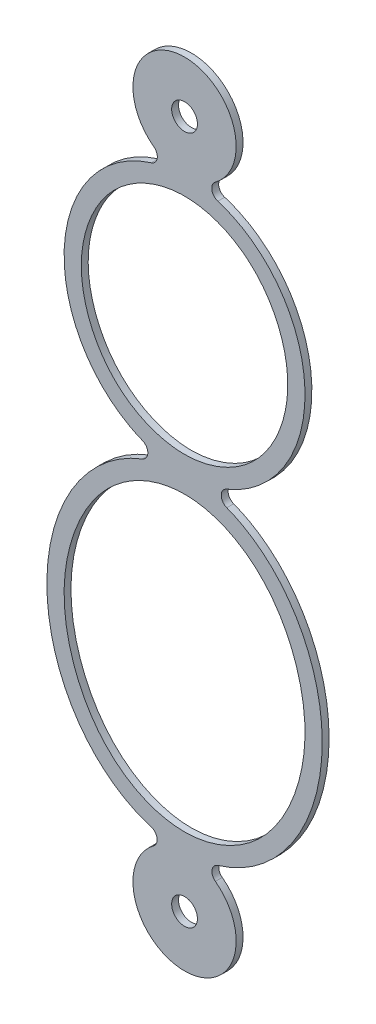
ISO-10303-21;
HEADER;
FILE_DESCRIPTION(('STEP AP214'),'2;1');
FILE_NAME('part.step','',(''),(''),'','','');
FILE_SCHEMA(('AUTOMOTIVE_DESIGN { 1 0 10303 214 1 1 1 1 }'));
ENDSEC;
DATA;
#1=APPLICATION_CONTEXT('core data for automotive mechanical design processes');
#2=APPLICATION_PROTOCOL_DEFINITION('international standard','automotive_design',2000,#1);
#3=PRODUCT_CONTEXT('',#1,'mechanical');
#4=PRODUCT('Part','Part','',(#3));
#5=PRODUCT_RELATED_PRODUCT_CATEGORY('part','',(#4));
#6=PRODUCT_DEFINITION_FORMATION('','',#4);
#7=PRODUCT_DEFINITION_CONTEXT('part definition',#1,'design');
#8=PRODUCT_DEFINITION('design','',#6,#7);
#9=PRODUCT_DEFINITION_SHAPE('','',#8);
#10=(LENGTH_UNIT() NAMED_UNIT(*) SI_UNIT(.MILLI.,.METRE.));
#11=(NAMED_UNIT(*) PLANE_ANGLE_UNIT() SI_UNIT($,.RADIAN.));
#12=(NAMED_UNIT(*) SI_UNIT($,.STERADIAN.) SOLID_ANGLE_UNIT());
#13=UNCERTAINTY_MEASURE_WITH_UNIT(LENGTH_MEASURE(1.E-05),#10,'distance_accuracy_value','');
#14=(GEOMETRIC_REPRESENTATION_CONTEXT(3) GLOBAL_UNCERTAINTY_ASSIGNED_CONTEXT((#13)) GLOBAL_UNIT_ASSIGNED_CONTEXT((#10,
#11,#12)) REPRESENTATION_CONTEXT('',''));
#15=CARTESIAN_POINT('',(0.,0.,0.));
#16=DIRECTION('',(0.,0.,1.));
#17=DIRECTION('',(1.,0.,0.));
#18=AXIS2_PLACEMENT_3D('',#15,#16,#17);
#19=CARTESIAN_POINT('',(0.,4.75,0.1));
#20=DIRECTION('',(0.,0.,1.));
#21=DIRECTION('',(1.,0.,0.));
#22=AXIS2_PLACEMENT_3D('',#19,#20,#21);
#23=PLANE('',#22);
#24=CARTESIAN_POINT('',(0.,1.5,0.1));
#25=CARTESIAN_POINT('',(0.77676920001799,1.5,0.1));
#26=CARTESIAN_POINT('',(2.33030760005397,2.18201490696649,0.1));
#27=CARTESIAN_POINT('',(3.33484619997302,4.75,0.1));
#28=CARTESIAN_POINT('',(2.33030760005397,7.31798509303351,0.1));
#29=CARTESIAN_POINT('',(0.,8.34100745348325,0.1));
#30=CARTESIAN_POINT('',(-2.33030760005397,7.31798509303351,0.1));
#31=CARTESIAN_POINT('',(-3.33484619997302,4.75,0.1));
#32=CARTESIAN_POINT('',(-2.33030760005397,2.18201490696649,0.1));
#33=CARTESIAN_POINT('',(-0.77676920001799,1.5,0.1));
#34=CARTESIAN_POINT('',(0.,1.5,0.1));
#35=B_SPLINE_CURVE_WITH_KNOTS('',3,(#24,#25,#26,#27,#28,#29,#30,#31,#32,#33,#34),.UNSPECIFIED.,
.T.,.F.,(4,1,1,1,1,1,1,1,4),(0.,0.785398163397448,1.5707963267949,2.35619449019234,
3.14159265358979,3.92699081698724,4.71238898038469,5.49778714378214,6.28318530717959),.UNSPECIFIED.);
#36=CARTESIAN_POINT('',(0.,1.5,0.1));
#37=VERTEX_POINT('',#36);
#38=EDGE_CURVE('E266',#37,#37,#35,.T.);
#39=ORIENTED_EDGE('',*,*,#38,.F.);
#40=EDGE_LOOP('',(#39));
#41=FACE_BOUND('',#40,.T.);
#42=CARTESIAN_POINT('',(0.,10.,0.1));
#43=DIRECTION('',(0.,0.,1.));
#44=DIRECTION('',(1.,0.,0.));
#45=AXIS2_PLACEMENT_3D('',#42,#43,#44);
#46=CIRCLE('',#45,0.375);
#47=CARTESIAN_POINT('',(0.374999999999999,10.,0.1));
#48=VERTEX_POINT('',#47);
#49=EDGE_CURVE('E160',#48,#48,#46,.T.);
#50=ORIENTED_EDGE('',*,*,#49,.F.);
#51=EDGE_LOOP('',(#50));
#52=FACE_BOUND('',#51,.T.);
#53=CARTESIAN_POINT('',(0.,4.75,0.1));
#54=DIRECTION('',(0.,0.,1.));
#55=DIRECTION('',(0.,-1.,0.));
#56=AXIS2_PLACEMENT_3D('',#53,#54,#55);
#57=ELLIPSE('',#56,3.75,3.5);
#58=CARTESIAN_POINT('',(-0.96696853472412,8.35404298690924,0.1));
#59=VERTEX_POINT('',#58);
#60=CARTESIAN_POINT('',(-1.22357103550407,1.23661696244466,0.1));
#61=VERTEX_POINT('',#60);
#62=EDGE_CURVE('E179',#59,#61,#57,.T.);
#63=ORIENTED_EDGE('',*,*,#62,.T.);
#64=CARTESIAN_POINT('',(-1.31637634818871,1.00448085164432,0.1));
#65=DIRECTION('',(0.,0.,-1.));
#66=DIRECTION('',(1.,0.,0.));
#67=AXIS2_PLACEMENT_3D('',#64,#65,#66);
#68=CIRCLE('',#67,0.25);
#69=CARTESIAN_POINT('',(-1.22701678477114,0.77099665854804,0.1));
#70=VERTEX_POINT('',#69);
#71=EDGE_CURVE('E107',#61,#70,#68,.T.);
#72=ORIENTED_EDGE('',*,*,#71,.T.);
#73=CARTESIAN_POINT('',(0.,-3.75,0.1));
#74=DIRECTION('',(0.,0.,1.));
#75=DIRECTION('',(0.,-1.,0.));
#76=AXIS2_PLACEMENT_3D('',#73,#74,#75);
#77=ELLIPSE('',#76,4.75,4.);
#78=CARTESIAN_POINT('',(-0.974024896603258,-8.3570218382292,0.1));
#79=VERTEX_POINT('',#78);
#80=EDGE_CURVE('E206',#70,#79,#77,.T.);
#81=ORIENTED_EDGE('',*,*,#80,.T.);
#82=CARTESIAN_POINT('',(-1.04545245373619,-8.59660085250638,0.1));
#83=DIRECTION('',(0.,0.,-1.));
#84=DIRECTION('',(1.,0.,0.));
#85=AXIS2_PLACEMENT_3D('',#82,#83,#84);
#86=CIRCLE('',#85,0.250000000025575);
#87=CARTESIAN_POINT('',(-0.896102103192263,-8.79708644501914,0.1));
#88=VERTEX_POINT('',#87);
#89=EDGE_CURVE('E225',#79,#88,#86,.T.);
#90=ORIENTED_EDGE('',*,*,#89,.T.);
#91=CARTESIAN_POINT('',(0.,-10.,0.1));
#92=DIRECTION('',(0.,0.,1.));
#93=DIRECTION('',(1.,0.,0.));
#94=AXIS2_PLACEMENT_3D('',#91,#92,#93);
#95=CIRCLE('',#94,1.50000000000852);
#96=CARTESIAN_POINT('',(0.896102103176992,-8.79708644503965,0.1));
#97=VERTEX_POINT('',#96);
#98=EDGE_CURVE('E222',#88,#97,#95,.T.);
#99=ORIENTED_EDGE('',*,*,#98,.T.);
#100=CARTESIAN_POINT('',(1.0454524537362,-8.59660085250638,0.1));
#101=DIRECTION('',(0.,0.,-1.));
#102=DIRECTION('',(1.,0.,0.));
#103=AXIS2_PLACEMENT_3D('',#100,#101,#102);
#104=CIRCLE('',#103,0.250000000025575);
#105=CARTESIAN_POINT('',(0.974024896595954,-8.35702183820469,0.1));
#106=VERTEX_POINT('',#105);
#107=EDGE_CURVE('E224',#97,#106,#104,.T.);
#108=ORIENTED_EDGE('',*,*,#107,.T.);
#109=CARTESIAN_POINT('',(0.,-3.75,0.1));
#110=DIRECTION('',(0.,0.,1.));
#111=DIRECTION('',(0.,-1.,0.));
#112=AXIS2_PLACEMENT_3D('',#109,#110,#111);
#113=ELLIPSE('',#112,4.75,4.);
#114=CARTESIAN_POINT('',(1.22701678477114,0.770996658548041,0.1));
#115=VERTEX_POINT('',#114);
#116=EDGE_CURVE('E227',#106,#115,#113,.T.);
#117=ORIENTED_EDGE('',*,*,#116,.T.);
#118=CARTESIAN_POINT('',(1.31637634818871,1.00448085164432,0.1));
#119=DIRECTION('',(0.,0.,-1.));
#120=DIRECTION('',(1.,0.,0.));
#121=AXIS2_PLACEMENT_3D('',#118,#119,#120);
#122=CIRCLE('',#121,0.25);
#123=CARTESIAN_POINT('',(1.22357103550407,1.23661696244466,0.1));
#124=VERTEX_POINT('',#123);
#125=EDGE_CURVE('E234',#115,#124,#122,.T.);
#126=ORIENTED_EDGE('',*,*,#125,.T.);
#127=CARTESIAN_POINT('',(0.,4.75,0.1));
#128=DIRECTION('',(0.,0.,1.));
#129=DIRECTION('',(0.,-1.,0.));
#130=AXIS2_PLACEMENT_3D('',#127,#128,#129);
#131=ELLIPSE('',#130,3.75,3.5);
#132=CARTESIAN_POINT('',(0.966968534724127,8.35404298690928,0.1));
#133=VERTEX_POINT('',#132);
#134=EDGE_CURVE('E138',#124,#133,#131,.T.);
#135=ORIENTED_EDGE('',*,*,#134,.T.);
#136=CARTESIAN_POINT('',(1.04055685860177,8.5929671560276,0.1));
#137=DIRECTION('',(0.,0.,-1.));
#138=DIRECTION('',(1.,0.,0.));
#139=AXIS2_PLACEMENT_3D('',#136,#137,#138);
#140=CIRCLE('',#139,0.250000000000038);
#141=CARTESIAN_POINT('',(0.891905878801503,8.79397184802368,0.1));
#142=VERTEX_POINT('',#141);
#143=EDGE_CURVE('E132',#133,#142,#140,.T.);
#144=ORIENTED_EDGE('',*,*,#143,.T.);
#145=CARTESIAN_POINT('',(0.,10.,0.1));
#146=DIRECTION('',(0.,0.,1.));
#147=DIRECTION('',(1.,0.,0.));
#148=AXIS2_PLACEMENT_3D('',#145,#146,#147);
#149=CIRCLE('',#148,1.5);
#150=CARTESIAN_POINT('',(-0.891905878801481,8.79397184802371,0.1));
#151=VERTEX_POINT('',#150);
#152=EDGE_CURVE('E136',#142,#151,#149,.T.);
#153=ORIENTED_EDGE('',*,*,#152,.T.);
#154=CARTESIAN_POINT('',(-1.04055685860177,8.5929671560276,0.1));
#155=DIRECTION('',(0.,0.,-1.));
#156=DIRECTION('',(1.,0.,0.));
#157=AXIS2_PLACEMENT_3D('',#154,#155,#156);
#158=CIRCLE('',#157,0.250000000000037);
#159=EDGE_CURVE('E52',#151,#59,#158,.T.);
#160=ORIENTED_EDGE('',*,*,#159,.T.);
#161=EDGE_LOOP('',(#63,#72,#81,#90,#99,#108,#117,#126,#135,#144,#153,#160));
#162=FACE_BOUND('',#161,.T.);
#163=CARTESIAN_POINT('',(0.,-10.,0.1));
#164=DIRECTION('',(0.,0.,1.));
#165=DIRECTION('',(1.,0.,0.));
#166=AXIS2_PLACEMENT_3D('',#163,#164,#165);
#167=CIRCLE('',#166,0.375);
#168=CARTESIAN_POINT('',(0.375000000000005,-10.,0.1));
#169=VERTEX_POINT('',#168);
#170=EDGE_CURVE('E260',#169,#169,#167,.T.);
#171=ORIENTED_EDGE('',*,*,#170,.F.);
#172=EDGE_LOOP('',(#171));
#173=FACE_BOUND('',#172,.T.);
#174=CARTESIAN_POINT('',(0.,-8.,0.1));
#175=CARTESIAN_POINT('',(0.897698014678666,-8.,0.1));
#176=CARTESIAN_POINT('',(2.693094044036,-7.13432457899094,0.1));
#177=CARTESIAN_POINT('',(3.903452977982,-3.75,0.1));
#178=CARTESIAN_POINT('',(2.693094044036,-0.365675421009065,0.1));
#179=CARTESIAN_POINT('',(0.,0.932837710504536,0.1));
#180=CARTESIAN_POINT('',(-2.693094044036,-0.365675421009064,0.1));
#181=CARTESIAN_POINT('',(-3.903452977982,-3.75,0.1));
#182=CARTESIAN_POINT('',(-2.693094044036,-7.13432457899093,0.1));
#183=CARTESIAN_POINT('',(-0.897698014678666,-8.,0.1));
#184=CARTESIAN_POINT('',(0.,-8.,0.1));
#185=B_SPLINE_CURVE_WITH_KNOTS('',3,(#174,#175,#176,#177,#178,#179,#180,#181,#182,#183,#184),
.UNSPECIFIED.,.T.,.F.,(4,1,1,1,1,1,1,1,4),(0.,0.785398163397448,1.5707963267949,
2.35619449019234,3.14159265358979,3.92699081698724,4.71238898038469,5.49778714378214,
6.28318530717959),.UNSPECIFIED.);
#186=CARTESIAN_POINT('',(0.,-8.,0.1));
#187=VERTEX_POINT('',#186);
#188=EDGE_CURVE('E274',#187,#187,#185,.T.);
#189=ORIENTED_EDGE('',*,*,#188,.F.);
#190=EDGE_LOOP('',(#189));
#191=FACE_BOUND('',#190,.T.);
#192=ADVANCED_FACE('F34',(#41,#52,#162,#173,#191),#23,.T.);
#193=CARTESIAN_POINT('',(0.,4.75,-0.1));
#194=DIRECTION('',(0.,0.,1.));
#195=DIRECTION('',(1.,0.,0.));
#196=AXIS2_PLACEMENT_3D('',#193,#194,#195);
#197=PLANE('',#196);
#198=CARTESIAN_POINT('',(0.,4.75,-0.1));
#199=DIRECTION('',(0.,0.,1.));
#200=DIRECTION('',(0.,-1.,0.));
#201=AXIS2_PLACEMENT_3D('',#198,#199,#200);
#202=ELLIPSE('',#201,3.75,3.5);
#203=CARTESIAN_POINT('',(-0.96696853472412,8.35404298690924,-0.1));
#204=VERTEX_POINT('',#203);
#205=CARTESIAN_POINT('',(-1.22357103550407,1.23661696244466,-0.1));
#206=VERTEX_POINT('',#205);
#207=EDGE_CURVE('E156',#204,#206,#202,.T.);
#208=ORIENTED_EDGE('',*,*,#207,.F.);
#209=CARTESIAN_POINT('',(-1.04055685860177,8.5929671560276,-0.1));
#210=DIRECTION('',(0.,0.,-1.));
#211=DIRECTION('',(1.,0.,0.));
#212=AXIS2_PLACEMENT_3D('',#209,#210,#211);
#213=CIRCLE('',#212,0.250000000000037);
#214=CARTESIAN_POINT('',(-0.891905878801481,8.79397184802371,-0.1));
#215=VERTEX_POINT('',#214);
#216=EDGE_CURVE('E99',#215,#204,#213,.T.);
#217=ORIENTED_EDGE('',*,*,#216,.F.);
#218=CARTESIAN_POINT('',(0.,10.,-0.1));
#219=DIRECTION('',(0.,0.,1.));
#220=DIRECTION('',(1.,0.,0.));
#221=AXIS2_PLACEMENT_3D('',#218,#219,#220);
#222=CIRCLE('',#221,1.5);
#223=CARTESIAN_POINT('',(0.891905878801503,8.79397184802368,-0.1));
#224=VERTEX_POINT('',#223);
#225=EDGE_CURVE('E93',#224,#215,#222,.T.);
#226=ORIENTED_EDGE('',*,*,#225,.F.);
#227=CARTESIAN_POINT('',(1.04055685860177,8.5929671560276,-0.1));
#228=DIRECTION('',(0.,0.,-1.));
#229=DIRECTION('',(1.,0.,0.));
#230=AXIS2_PLACEMENT_3D('',#227,#228,#229);
#231=CIRCLE('',#230,0.250000000000038);
#232=CARTESIAN_POINT('',(0.966968534724127,8.35404298690928,-0.1));
#233=VERTEX_POINT('',#232);
#234=EDGE_CURVE('E146',#233,#224,#231,.T.);
#235=ORIENTED_EDGE('',*,*,#234,.F.);
#236=CARTESIAN_POINT('',(0.,4.75,-0.1));
#237=DIRECTION('',(0.,0.,1.));
#238=DIRECTION('',(0.,-1.,0.));
#239=AXIS2_PLACEMENT_3D('',#236,#237,#238);
#240=ELLIPSE('',#239,3.75,3.5);
#241=CARTESIAN_POINT('',(1.22357103550407,1.23661696244466,-0.1));
#242=VERTEX_POINT('',#241);
#243=EDGE_CURVE('E174',#242,#233,#240,.T.);
#244=ORIENTED_EDGE('',*,*,#243,.F.);
#245=CARTESIAN_POINT('',(1.31637634818871,1.00448085164432,-0.1));
#246=DIRECTION('',(0.,0.,-1.));
#247=DIRECTION('',(1.,0.,0.));
#248=AXIS2_PLACEMENT_3D('',#245,#246,#247);
#249=CIRCLE('',#248,0.25);
#250=CARTESIAN_POINT('',(1.22701678477114,0.770996658548041,-0.1));
#251=VERTEX_POINT('',#250);
#252=EDGE_CURVE('E172',#251,#242,#249,.T.);
#253=ORIENTED_EDGE('',*,*,#252,.F.);
#254=CARTESIAN_POINT('',(0.,-3.75,-0.1));
#255=DIRECTION('',(0.,0.,1.));
#256=DIRECTION('',(0.,-1.,0.));
#257=AXIS2_PLACEMENT_3D('',#254,#255,#256);
#258=ELLIPSE('',#257,4.75,4.);
#259=CARTESIAN_POINT('',(0.974024896595954,-8.35702183820469,-0.1));
#260=VERTEX_POINT('',#259);
#261=EDGE_CURVE('E170',#260,#251,#258,.T.);
#262=ORIENTED_EDGE('',*,*,#261,.F.);
#263=CARTESIAN_POINT('',(1.0454524537362,-8.59660085250638,-0.1));
#264=DIRECTION('',(0.,0.,-1.));
#265=DIRECTION('',(1.,0.,0.));
#266=AXIS2_PLACEMENT_3D('',#263,#264,#265);
#267=CIRCLE('',#266,0.250000000025575);
#268=CARTESIAN_POINT('',(0.896102103176992,-8.79708644503965,-0.1));
#269=VERTEX_POINT('',#268);
#270=EDGE_CURVE('E168',#269,#260,#267,.T.);
#271=ORIENTED_EDGE('',*,*,#270,.F.);
#272=CARTESIAN_POINT('',(0.,-10.,-0.1));
#273=DIRECTION('',(0.,0.,1.));
#274=DIRECTION('',(1.,0.,0.));
#275=AXIS2_PLACEMENT_3D('',#272,#273,#274);
#276=CIRCLE('',#275,1.50000000000852);
#277=CARTESIAN_POINT('',(-0.896102103192263,-8.79708644501914,-0.1));
#278=VERTEX_POINT('',#277);
#279=EDGE_CURVE('E166',#278,#269,#276,.T.);
#280=ORIENTED_EDGE('',*,*,#279,.F.);
#281=CARTESIAN_POINT('',(-1.04545245373619,-8.59660085250638,-0.1));
#282=DIRECTION('',(0.,0.,-1.));
#283=DIRECTION('',(1.,0.,0.));
#284=AXIS2_PLACEMENT_3D('',#281,#282,#283);
#285=CIRCLE('',#284,0.250000000025575);
#286=CARTESIAN_POINT('',(-0.974024896603258,-8.3570218382292,-0.1));
#287=VERTEX_POINT('',#286);
#288=EDGE_CURVE('E164',#287,#278,#285,.T.);
#289=ORIENTED_EDGE('',*,*,#288,.F.);
#290=CARTESIAN_POINT('',(0.,-3.75,-0.1));
#291=DIRECTION('',(0.,0.,1.));
#292=DIRECTION('',(0.,-1.,0.));
#293=AXIS2_PLACEMENT_3D('',#290,#291,#292);
#294=ELLIPSE('',#293,4.75,4.);
#295=CARTESIAN_POINT('',(-1.22701678477114,0.77099665854804,-0.1));
#296=VERTEX_POINT('',#295);
#297=EDGE_CURVE('E162',#296,#287,#294,.T.);
#298=ORIENTED_EDGE('',*,*,#297,.F.);
#299=CARTESIAN_POINT('',(-1.31637634818871,1.00448085164432,-0.1));
#300=DIRECTION('',(0.,0.,-1.));
#301=DIRECTION('',(1.,0.,0.));
#302=AXIS2_PLACEMENT_3D('',#299,#300,#301);
#303=CIRCLE('',#302,0.25);
#304=EDGE_CURVE('E159',#206,#296,#303,.T.);
#305=ORIENTED_EDGE('',*,*,#304,.F.);
#306=EDGE_LOOP('',(#208,#217,#226,#235,#244,#253,#262,#271,#280,#289,#298,#305));
#307=FACE_BOUND('',#306,.T.);
#308=CARTESIAN_POINT('',(0.,10.,-0.1));
#309=DIRECTION('',(0.,0.,1.));
#310=DIRECTION('',(1.,0.,0.));
#311=AXIS2_PLACEMENT_3D('',#308,#309,#310);
#312=CIRCLE('',#311,0.375);
#313=CARTESIAN_POINT('',(0.374999999999999,10.,-0.1));
#314=VERTEX_POINT('',#313);
#315=EDGE_CURVE('E257',#314,#314,#312,.T.);
#316=ORIENTED_EDGE('',*,*,#315,.T.);
#317=EDGE_LOOP('',(#316));
#318=FACE_BOUND('',#317,.T.);
#319=CARTESIAN_POINT('',(0.,-10.,-0.1));
#320=DIRECTION('',(0.,0.,1.));
#321=DIRECTION('',(1.,0.,0.));
#322=AXIS2_PLACEMENT_3D('',#319,#320,#321);
#323=CIRCLE('',#322,0.375);
#324=CARTESIAN_POINT('',(0.375000000000005,-10.,-0.1));
#325=VERTEX_POINT('',#324);
#326=EDGE_CURVE('E263',#325,#325,#323,.T.);
#327=ORIENTED_EDGE('',*,*,#326,.T.);
#328=EDGE_LOOP('',(#327));
#329=FACE_BOUND('',#328,.T.);
#330=CARTESIAN_POINT('',(0.,1.5,-0.1));
#331=CARTESIAN_POINT('',(0.77676920001799,1.5,-0.1));
#332=CARTESIAN_POINT('',(2.33030760005397,2.18201490696649,-0.1));
#333=CARTESIAN_POINT('',(3.33484619997302,4.75,-0.1));
#334=CARTESIAN_POINT('',(2.33030760005397,7.31798509303351,-0.1));
#335=CARTESIAN_POINT('',(0.,8.34100745348325,-0.1));
#336=CARTESIAN_POINT('',(-2.33030760005397,7.31798509303351,-0.1));
#337=CARTESIAN_POINT('',(-3.33484619997302,4.75,-0.1));
#338=CARTESIAN_POINT('',(-2.33030760005397,2.18201490696649,-0.1));
#339=CARTESIAN_POINT('',(-0.77676920001799,1.5,-0.1));
#340=CARTESIAN_POINT('',(0.,1.5,-0.1));
#341=B_SPLINE_CURVE_WITH_KNOTS('',3,(#330,#331,#332,#333,#334,#335,#336,#337,#338,#339,#340),
.UNSPECIFIED.,.T.,.F.,(4,1,1,1,1,1,1,1,4),(0.,0.785398163397448,1.5707963267949,
2.35619449019234,3.14159265358979,3.92699081698724,4.71238898038469,5.49778714378214,
6.28318530717959),.UNSPECIFIED.);
#342=CARTESIAN_POINT('',(0.,1.5,-0.1));
#343=VERTEX_POINT('',#342);
#344=EDGE_CURVE('E269',#343,#343,#341,.T.);
#345=ORIENTED_EDGE('',*,*,#344,.T.);
#346=EDGE_LOOP('',(#345));
#347=FACE_BOUND('',#346,.T.);
#348=CARTESIAN_POINT('',(0.,-8.,-0.1));
#349=CARTESIAN_POINT('',(0.897698014678666,-8.,-0.1));
#350=CARTESIAN_POINT('',(2.693094044036,-7.13432457899094,-0.1));
#351=CARTESIAN_POINT('',(3.903452977982,-3.75,-0.1));
#352=CARTESIAN_POINT('',(2.693094044036,-0.365675421009065,-0.1));
#353=CARTESIAN_POINT('',(0.,0.932837710504536,-0.1));
#354=CARTESIAN_POINT('',(-2.693094044036,-0.365675421009064,-0.1));
#355=CARTESIAN_POINT('',(-3.903452977982,-3.75,-0.1));
#356=CARTESIAN_POINT('',(-2.693094044036,-7.13432457899093,-0.1));
#357=CARTESIAN_POINT('',(-0.897698014678666,-8.,-0.1));
#358=CARTESIAN_POINT('',(0.,-8.,-0.1));
#359=B_SPLINE_CURVE_WITH_KNOTS('',3,(#348,#349,#350,#351,#352,#353,#354,#355,#356,#357,#358),
.UNSPECIFIED.,.T.,.F.,(4,1,1,1,1,1,1,1,4),(0.,0.785398163397448,1.5707963267949,
2.35619449019234,3.14159265358979,3.92699081698724,4.71238898038469,5.49778714378214,
6.28318530717959),.UNSPECIFIED.);
#360=CARTESIAN_POINT('',(0.,-8.,-0.1));
#361=VERTEX_POINT('',#360);
#362=EDGE_CURVE('E283',#361,#361,#359,.T.);
#363=ORIENTED_EDGE('',*,*,#362,.T.);
#364=EDGE_LOOP('',(#363));
#365=FACE_BOUND('',#364,.T.);
#366=ADVANCED_FACE('F210',(#307,#318,#329,#347,#365),#197,.F.);
#367=DIRECTION('',(0.,0.,-1.));
#368=VECTOR('',#367,1.);
#369=SURFACE_OF_LINEAR_EXTRUSION('',#57,#368);
#370=ORIENTED_EDGE('',*,*,#207,.T.);
#371=DIRECTION('',(0.,0.,-1.));
#372=VECTOR('',#371,1.);
#373=CARTESIAN_POINT('',(-1.22357103550407,1.23661696244466,0.1));
#374=LINE('',#373,#372);
#375=EDGE_CURVE('E11',#61,#206,#374,.T.);
#376=ORIENTED_EDGE('',*,*,#375,.F.);
#377=ORIENTED_EDGE('',*,*,#62,.F.);
#378=DIRECTION('',(0.,0.,-1.));
#379=VECTOR('',#378,1.);
#380=CARTESIAN_POINT('',(-0.96696853472412,8.35404298690924,0.1));
#381=LINE('',#380,#379);
#382=EDGE_CURVE('E152',#59,#204,#381,.T.);
#383=ORIENTED_EDGE('',*,*,#382,.T.);
#384=EDGE_LOOP('',(#370,#376,#377,#383));
#385=FACE_BOUND('',#384,.T.);
#386=ADVANCED_FACE('F36',(#385),#369,.F.);
#387=CARTESIAN_POINT('',(-1.31637634818871,1.00448085164432,0.1));
#388=DIRECTION('',(0.,0.,-1.));
#389=DIRECTION('',(-1.,0.,0.));
#390=AXIS2_PLACEMENT_3D('',#387,#388,#389);
#391=CYLINDRICAL_SURFACE('',#390,0.25);
#392=ORIENTED_EDGE('',*,*,#304,.T.);
#393=DIRECTION('',(0.,0.,-1.));
#394=VECTOR('',#393,1.);
#395=CARTESIAN_POINT('',(-1.22701678477114,0.77099665854804,0.1));
#396=LINE('',#395,#394);
#397=EDGE_CURVE('E44',#70,#296,#396,.T.);
#398=ORIENTED_EDGE('',*,*,#397,.F.);
#399=ORIENTED_EDGE('',*,*,#71,.F.);
#400=ORIENTED_EDGE('',*,*,#375,.T.);
#401=EDGE_LOOP('',(#392,#398,#399,#400));
#402=FACE_BOUND('',#401,.T.);
#403=ADVANCED_FACE('F252',(#402),#391,.F.);
#404=DIRECTION('',(0.,0.,-1.));
#405=VECTOR('',#404,1.);
#406=SURFACE_OF_LINEAR_EXTRUSION('',#77,#405);
#407=ORIENTED_EDGE('',*,*,#297,.T.);
#408=DIRECTION('',(0.,0.,-1.));
#409=VECTOR('',#408,1.);
#410=CARTESIAN_POINT('',(-0.974024896603258,-8.3570218382292,0.1));
#411=LINE('',#410,#409);
#412=EDGE_CURVE('E198',#79,#287,#411,.T.);
#413=ORIENTED_EDGE('',*,*,#412,.F.);
#414=ORIENTED_EDGE('',*,*,#80,.F.);
#415=ORIENTED_EDGE('',*,*,#397,.T.);
#416=EDGE_LOOP('',(#407,#413,#414,#415));
#417=FACE_BOUND('',#416,.T.);
#418=ADVANCED_FACE('F204',(#417),#406,.F.);
#419=CARTESIAN_POINT('',(-1.04545245373619,-8.59660085250638,0.1));
#420=DIRECTION('',(0.,0.,-1.));
#421=DIRECTION('',(-1.,0.,0.));
#422=AXIS2_PLACEMENT_3D('',#419,#420,#421);
#423=CYLINDRICAL_SURFACE('',#422,0.250000000025575);
#424=ORIENTED_EDGE('',*,*,#288,.T.);
#425=DIRECTION('',(0.,0.,-1.));
#426=VECTOR('',#425,1.);
#427=CARTESIAN_POINT('',(-0.896102103192263,-8.79708644501914,0.1));
#428=LINE('',#427,#426);
#429=EDGE_CURVE('E195',#88,#278,#428,.T.);
#430=ORIENTED_EDGE('',*,*,#429,.F.);
#431=ORIENTED_EDGE('',*,*,#89,.F.);
#432=ORIENTED_EDGE('',*,*,#412,.T.);
#433=EDGE_LOOP('',(#424,#430,#431,#432));
#434=FACE_BOUND('',#433,.T.);
#435=ADVANCED_FACE('F216',(#434),#423,.F.);
#436=CARTESIAN_POINT('',(0.,-10.,0.1));
#437=DIRECTION('',(0.,0.,-1.));
#438=DIRECTION('',(-1.,0.,0.));
#439=AXIS2_PLACEMENT_3D('',#436,#437,#438);
#440=CYLINDRICAL_SURFACE('',#439,1.50000000000852);
#441=ORIENTED_EDGE('',*,*,#279,.T.);
#442=DIRECTION('',(0.,0.,-1.));
#443=VECTOR('',#442,1.);
#444=CARTESIAN_POINT('',(0.896102103176992,-8.79708644503965,0.1));
#445=LINE('',#444,#443);
#446=EDGE_CURVE('E192',#97,#269,#445,.T.);
#447=ORIENTED_EDGE('',*,*,#446,.F.);
#448=ORIENTED_EDGE('',*,*,#98,.F.);
#449=ORIENTED_EDGE('',*,*,#429,.T.);
#450=EDGE_LOOP('',(#441,#447,#448,#449));
#451=FACE_BOUND('',#450,.T.);
#452=ADVANCED_FACE('F220',(#451),#440,.T.);
#453=CARTESIAN_POINT('',(1.0454524537362,-8.59660085250638,0.1));
#454=DIRECTION('',(0.,0.,-1.));
#455=DIRECTION('',(-1.,0.,0.));
#456=AXIS2_PLACEMENT_3D('',#453,#454,#455);
#457=CYLINDRICAL_SURFACE('',#456,0.250000000025575);
#458=ORIENTED_EDGE('',*,*,#270,.T.);
#459=DIRECTION('',(0.,0.,-1.));
#460=VECTOR('',#459,1.);
#461=CARTESIAN_POINT('',(0.974024896595954,-8.35702183820469,0.1));
#462=LINE('',#461,#460);
#463=EDGE_CURVE('E189',#106,#260,#462,.T.);
#464=ORIENTED_EDGE('',*,*,#463,.F.);
#465=ORIENTED_EDGE('',*,*,#107,.F.);
#466=ORIENTED_EDGE('',*,*,#446,.T.);
#467=EDGE_LOOP('',(#458,#464,#465,#466));
#468=FACE_BOUND('',#467,.T.);
#469=ADVANCED_FACE('F241',(#468),#457,.F.);
#470=DIRECTION('',(0.,0.,-1.));
#471=VECTOR('',#470,1.);
#472=SURFACE_OF_LINEAR_EXTRUSION('',#113,#471);
#473=ORIENTED_EDGE('',*,*,#261,.T.);
#474=DIRECTION('',(0.,0.,-1.));
#475=VECTOR('',#474,1.);
#476=CARTESIAN_POINT('',(1.22701678477114,0.770996658548041,0.1));
#477=LINE('',#476,#475);
#478=EDGE_CURVE('E186',#115,#251,#477,.T.);
#479=ORIENTED_EDGE('',*,*,#478,.F.);
#480=ORIENTED_EDGE('',*,*,#116,.F.);
#481=ORIENTED_EDGE('',*,*,#463,.T.);
#482=EDGE_LOOP('',(#473,#479,#480,#481));
#483=FACE_BOUND('',#482,.T.);
#484=ADVANCED_FACE('F236',(#483),#472,.F.);
#485=CARTESIAN_POINT('',(1.31637634818871,1.00448085164432,0.1));
#486=DIRECTION('',(0.,0.,-1.));
#487=DIRECTION('',(-1.,0.,0.));
#488=AXIS2_PLACEMENT_3D('',#485,#486,#487);
#489=CYLINDRICAL_SURFACE('',#488,0.25);
#490=ORIENTED_EDGE('',*,*,#252,.T.);
#491=DIRECTION('',(0.,0.,-1.));
#492=VECTOR('',#491,1.);
#493=CARTESIAN_POINT('',(1.22357103550407,1.23661696244466,0.1));
#494=LINE('',#493,#492);
#495=EDGE_CURVE('E183',#124,#242,#494,.T.);
#496=ORIENTED_EDGE('',*,*,#495,.F.);
#497=ORIENTED_EDGE('',*,*,#125,.F.);
#498=ORIENTED_EDGE('',*,*,#478,.T.);
#499=EDGE_LOOP('',(#490,#496,#497,#498));
#500=FACE_BOUND('',#499,.T.);
#501=ADVANCED_FACE('F240',(#500),#489,.F.);
#502=DIRECTION('',(0.,0.,-1.));
#503=VECTOR('',#502,1.);
#504=SURFACE_OF_LINEAR_EXTRUSION('',#131,#503);
#505=ORIENTED_EDGE('',*,*,#243,.T.);
#506=DIRECTION('',(0.,0.,-1.));
#507=VECTOR('',#506,1.);
#508=CARTESIAN_POINT('',(0.966968534724127,8.35404298690928,0.1));
#509=LINE('',#508,#507);
#510=EDGE_CURVE('E147',#133,#233,#509,.T.);
#511=ORIENTED_EDGE('',*,*,#510,.F.);
#512=ORIENTED_EDGE('',*,*,#134,.F.);
#513=ORIENTED_EDGE('',*,*,#495,.T.);
#514=EDGE_LOOP('',(#505,#511,#512,#513));
#515=FACE_BOUND('',#514,.T.);
#516=ADVANCED_FACE('F316',(#515),#504,.F.);
#517=CARTESIAN_POINT('',(1.04055685860177,8.5929671560276,0.1));
#518=DIRECTION('',(0.,0.,-1.));
#519=DIRECTION('',(-1.,0.,0.));
#520=AXIS2_PLACEMENT_3D('',#517,#518,#519);
#521=CYLINDRICAL_SURFACE('',#520,0.250000000000038);
#522=ORIENTED_EDGE('',*,*,#234,.T.);
#523=DIRECTION('',(0.,0.,-1.));
#524=VECTOR('',#523,1.);
#525=CARTESIAN_POINT('',(0.891905878801503,8.79397184802368,0.1));
#526=LINE('',#525,#524);
#527=EDGE_CURVE('E143',#142,#224,#526,.T.);
#528=ORIENTED_EDGE('',*,*,#527,.F.);
#529=ORIENTED_EDGE('',*,*,#143,.F.);
#530=ORIENTED_EDGE('',*,*,#510,.T.);
#531=EDGE_LOOP('',(#522,#528,#529,#530));
#532=FACE_BOUND('',#531,.T.);
#533=ADVANCED_FACE('F144',(#532),#521,.F.);
#534=CARTESIAN_POINT('',(0.,10.,0.1));
#535=DIRECTION('',(0.,0.,-1.));
#536=DIRECTION('',(-1.,0.,0.));
#537=AXIS2_PLACEMENT_3D('',#534,#535,#536);
#538=CYLINDRICAL_SURFACE('',#537,1.5);
#539=ORIENTED_EDGE('',*,*,#225,.T.);
#540=DIRECTION('',(0.,0.,-1.));
#541=VECTOR('',#540,1.);
#542=CARTESIAN_POINT('',(-0.891905878801481,8.79397184802371,0.1));
#543=LINE('',#542,#541);
#544=EDGE_CURVE('E148',#151,#215,#543,.T.);
#545=ORIENTED_EDGE('',*,*,#544,.F.);
#546=ORIENTED_EDGE('',*,*,#152,.F.);
#547=ORIENTED_EDGE('',*,*,#527,.T.);
#548=EDGE_LOOP('',(#539,#545,#546,#547));
#549=FACE_BOUND('',#548,.T.);
#550=ADVANCED_FACE('F150',(#549),#538,.T.);
#551=CARTESIAN_POINT('',(-1.04055685860177,8.5929671560276,0.1));
#552=DIRECTION('',(0.,0.,-1.));
#553=DIRECTION('',(-1.,0.,0.));
#554=AXIS2_PLACEMENT_3D('',#551,#552,#553);
#555=CYLINDRICAL_SURFACE('',#554,0.250000000000037);
#556=ORIENTED_EDGE('',*,*,#216,.T.);
#557=ORIENTED_EDGE('',*,*,#382,.F.);
#558=ORIENTED_EDGE('',*,*,#159,.F.);
#559=ORIENTED_EDGE('',*,*,#544,.T.);
#560=EDGE_LOOP('',(#556,#557,#558,#559));
#561=FACE_BOUND('',#560,.T.);
#562=ADVANCED_FACE('F304',(#561),#555,.F.);
#563=CARTESIAN_POINT('',(0.,10.,0.1));
#564=DIRECTION('',(0.,0.,-1.));
#565=DIRECTION('',(-1.,0.,0.));
#566=AXIS2_PLACEMENT_3D('',#563,#564,#565);
#567=CYLINDRICAL_SURFACE('',#566,0.375);
#568=ORIENTED_EDGE('',*,*,#49,.T.);
#569=EDGE_LOOP('',(#568));
#570=FACE_BOUND('',#569,.T.);
#571=ORIENTED_EDGE('',*,*,#315,.F.);
#572=EDGE_LOOP('',(#571));
#573=FACE_BOUND('',#572,.T.);
#574=ADVANCED_FACE('F300',(#570,#573),#567,.F.);
#575=CARTESIAN_POINT('',(0.,-10.,0.1));
#576=DIRECTION('',(0.,0.,-1.));
#577=DIRECTION('',(-1.,0.,0.));
#578=AXIS2_PLACEMENT_3D('',#575,#576,#577);
#579=CYLINDRICAL_SURFACE('',#578,0.375);
#580=ORIENTED_EDGE('',*,*,#170,.T.);
#581=EDGE_LOOP('',(#580));
#582=FACE_BOUND('',#581,.T.);
#583=ORIENTED_EDGE('',*,*,#326,.F.);
#584=EDGE_LOOP('',(#583));
#585=FACE_BOUND('',#584,.T.);
#586=ADVANCED_FACE('F296',(#582,#585),#579,.F.);
#587=DIRECTION('',(0.,0.,-1.));
#588=VECTOR('',#587,1.);
#589=SURFACE_OF_LINEAR_EXTRUSION('',#35,#588);
#590=ORIENTED_EDGE('',*,*,#38,.T.);
#591=EDGE_LOOP('',(#590));
#592=FACE_BOUND('',#591,.T.);
#593=ORIENTED_EDGE('',*,*,#344,.F.);
#594=EDGE_LOOP('',(#593));
#595=FACE_BOUND('',#594,.T.);
#596=ADVANCED_FACE('F291',(#592,#595),#589,.T.);
#597=DIRECTION('',(0.,0.,-1.));
#598=VECTOR('',#597,1.);
#599=SURFACE_OF_LINEAR_EXTRUSION('',#185,#598);
#600=ORIENTED_EDGE('',*,*,#188,.T.);
#601=EDGE_LOOP('',(#600));
#602=FACE_BOUND('',#601,.T.);
#603=ORIENTED_EDGE('',*,*,#362,.F.);
#604=EDGE_LOOP('',(#603));
#605=FACE_BOUND('',#604,.T.);
#606=ADVANCED_FACE('F295',(#602,#605),#599,.T.);
#607=CLOSED_SHELL('',(#192,#366,#386,#403,#418,#435,#452,#469,#484,#501,#516,#533,#550,#562,
#574,#586,#596,#606));
#608=MANIFOLD_SOLID_BREP('B2',#607);
#609=ADVANCED_BREP_SHAPE_REPRESENTATION('',(#18,#608),#14);
#610=SHAPE_DEFINITION_REPRESENTATION(#9,#609);
ENDSEC;
END-ISO-10303-21;
